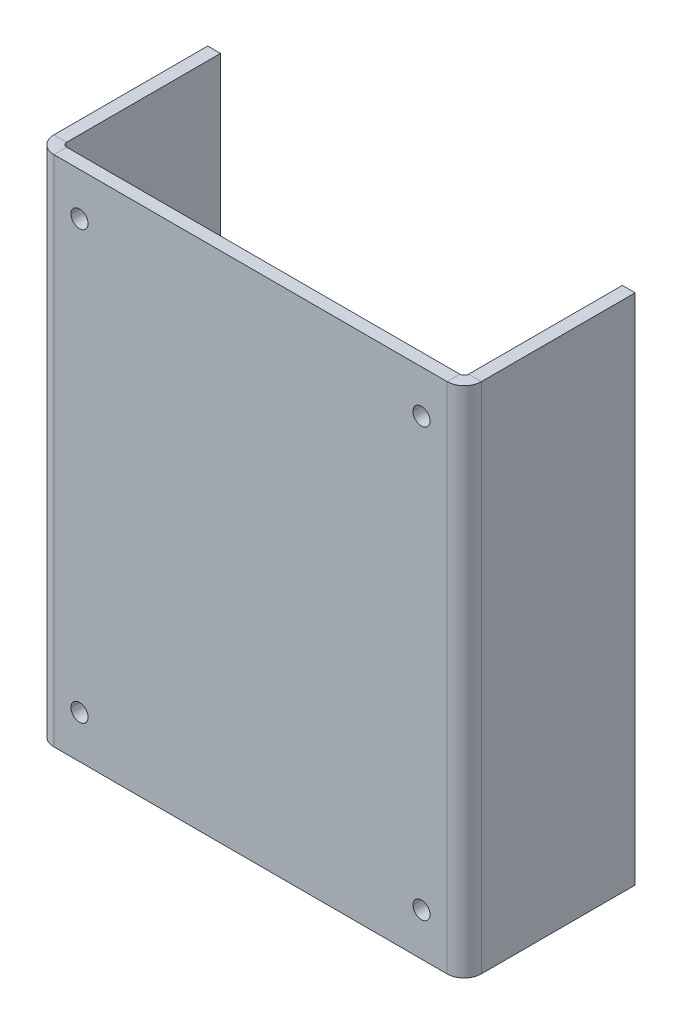
ISO-10303-21;
HEADER;
FILE_DESCRIPTION(('STEP AP214'),'2;1');
FILE_NAME('part.step','',(''),(''),'','','');
FILE_SCHEMA(('AUTOMOTIVE_DESIGN { 1 0 10303 214 1 1 1 1 }'));
ENDSEC;
DATA;
#1=APPLICATION_CONTEXT('core data for automotive mechanical design processes');
#2=APPLICATION_PROTOCOL_DEFINITION('international standard','automotive_design',2000,#1);
#3=PRODUCT_CONTEXT('',#1,'mechanical');
#4=PRODUCT('Part','Part','',(#3));
#5=PRODUCT_RELATED_PRODUCT_CATEGORY('part','',(#4));
#6=PRODUCT_DEFINITION_FORMATION('','',#4);
#7=PRODUCT_DEFINITION_CONTEXT('part definition',#1,'design');
#8=PRODUCT_DEFINITION('design','',#6,#7);
#9=PRODUCT_DEFINITION_SHAPE('','',#8);
#10=(LENGTH_UNIT() NAMED_UNIT(*) SI_UNIT(.MILLI.,.METRE.));
#11=(NAMED_UNIT(*) PLANE_ANGLE_UNIT() SI_UNIT($,.RADIAN.));
#12=(NAMED_UNIT(*) SI_UNIT($,.STERADIAN.) SOLID_ANGLE_UNIT());
#13=UNCERTAINTY_MEASURE_WITH_UNIT(LENGTH_MEASURE(1.E-05),#10,'distance_accuracy_value','');
#14=(GEOMETRIC_REPRESENTATION_CONTEXT(3) GLOBAL_UNCERTAINTY_ASSIGNED_CONTEXT((#13)) GLOBAL_UNIT_ASSIGNED_CONTEXT((#10,
#11,#12)) REPRESENTATION_CONTEXT('',''));
#15=CARTESIAN_POINT('',(0.,0.,0.));
#16=DIRECTION('',(0.,0.,1.));
#17=DIRECTION('',(1.,0.,0.));
#18=AXIS2_PLACEMENT_3D('',#15,#16,#17);
#19=CARTESIAN_POINT('',(-40.,10.,-40.001));
#20=DIRECTION('',(0.,0.,1.));
#21=DIRECTION('',(1.,0.,0.));
#22=AXIS2_PLACEMENT_3D('',#19,#20,#21);
#23=CYLINDRICAL_SURFACE('',#22,2.);
#24=DIRECTION('',(0.,0.,1.));
#25=VECTOR('',#24,1.);
#26=CARTESIAN_POINT('',(-42.,10.,-40.001));
#27=LINE('',#26,#25);
#28=CARTESIAN_POINT('',(-42.,10.,-3.));
#29=VERTEX_POINT('',#28);
#30=CARTESIAN_POINT('',(-42.,10.,-7.77156117277904E-13));
#31=VERTEX_POINT('',#30);
#32=EDGE_CURVE('E323',#29,#31,#27,.T.);
#33=ORIENTED_EDGE('',*,*,#32,.F.);
#34=CARTESIAN_POINT('',(-40.,10.,-3.));
#35=DIRECTION('',(0.,0.,-1.));
#36=DIRECTION('',(1.,0.,0.));
#37=AXIS2_PLACEMENT_3D('',#34,#35,#36);
#38=CIRCLE('',#37,2.);
#39=CARTESIAN_POINT('',(-38.,10.,-3.));
#40=VERTEX_POINT('',#39);
#41=EDGE_CURVE('E314',#29,#40,#38,.T.);
#42=ORIENTED_EDGE('',*,*,#41,.T.);
#43=DIRECTION('',(0.,0.,1.));
#44=VECTOR('',#43,1.);
#45=CARTESIAN_POINT('',(-38.,10.,-40.001));
#46=LINE('',#45,#44);
#47=CARTESIAN_POINT('',(-38.,10.,-7.77156117291914E-13));
#48=VERTEX_POINT('',#47);
#49=EDGE_CURVE('E271',#40,#48,#46,.T.);
#50=ORIENTED_EDGE('',*,*,#49,.T.);
#51=CARTESIAN_POINT('',(-40.,10.,-7.7715611723761E-13));
#52=DIRECTION('',(0.,0.,1.));
#53=DIRECTION('',(1.,0.,0.));
#54=AXIS2_PLACEMENT_3D('',#51,#52,#53);
#55=CIRCLE('',#54,2.);
#56=EDGE_CURVE('E281',#48,#31,#55,.T.);
#57=ORIENTED_EDGE('',*,*,#56,.T.);
#58=EDGE_LOOP('',(#33,#42,#50,#57));
#59=FACE_BOUND('',#58,.T.);
#60=ADVANCED_FACE('F17',(#59),#23,.F.);
#61=CARTESIAN_POINT('',(40.,10.,-40.001));
#62=DIRECTION('',(0.,0.,1.));
#63=DIRECTION('',(1.,0.,0.));
#64=AXIS2_PLACEMENT_3D('',#61,#62,#63);
#65=CYLINDRICAL_SURFACE('',#64,2.);
#66=DIRECTION('',(0.,0.,1.));
#67=VECTOR('',#66,1.);
#68=CARTESIAN_POINT('',(38.,10.,-40.001));
#69=LINE('',#68,#67);
#70=CARTESIAN_POINT('',(38.,10.,-3.));
#71=VERTEX_POINT('',#70);
#72=CARTESIAN_POINT('',(38.,10.,0.));
#73=VERTEX_POINT('',#72);
#74=EDGE_CURVE('E270',#71,#73,#69,.T.);
#75=ORIENTED_EDGE('',*,*,#74,.F.);
#76=CARTESIAN_POINT('',(40.,10.,-3.));
#77=DIRECTION('',(0.,0.,-1.));
#78=DIRECTION('',(1.,0.,0.));
#79=AXIS2_PLACEMENT_3D('',#76,#77,#78);
#80=CIRCLE('',#79,2.);
#81=CARTESIAN_POINT('',(42.,10.,-3.));
#82=VERTEX_POINT('',#81);
#83=EDGE_CURVE('E350',#71,#82,#80,.T.);
#84=ORIENTED_EDGE('',*,*,#83,.T.);
#85=DIRECTION('',(0.,0.,1.));
#86=VECTOR('',#85,1.);
#87=CARTESIAN_POINT('',(42.,10.,-40.001));
#88=LINE('',#87,#86);
#89=CARTESIAN_POINT('',(42.,10.0000000000009,0.));
#90=VERTEX_POINT('',#89);
#91=EDGE_CURVE('E295',#82,#90,#88,.T.);
#92=ORIENTED_EDGE('',*,*,#91,.T.);
#93=CARTESIAN_POINT('',(40.,10.0000000000009,0.));
#94=DIRECTION('',(0.,0.,1.));
#95=DIRECTION('',(1.,0.,0.));
#96=AXIS2_PLACEMENT_3D('',#93,#94,#95);
#97=CIRCLE('',#96,2.);
#98=EDGE_CURVE('E335',#90,#73,#97,.T.);
#99=ORIENTED_EDGE('',*,*,#98,.T.);
#100=EDGE_LOOP('',(#75,#84,#92,#99));
#101=FACE_BOUND('',#100,.T.);
#102=ADVANCED_FACE('F754',(#101),#65,.F.);
#103=CARTESIAN_POINT('',(40.,110.,-40.001));
#104=DIRECTION('',(0.,0.,1.));
#105=DIRECTION('',(1.,0.,0.));
#106=AXIS2_PLACEMENT_3D('',#103,#104,#105);
#107=CYLINDRICAL_SURFACE('',#106,2.);
#108=DIRECTION('',(0.,0.,1.));
#109=VECTOR('',#108,1.);
#110=CARTESIAN_POINT('',(38.,110.,-40.001));
#111=LINE('',#110,#109);
#112=CARTESIAN_POINT('',(38.,110.,-3.00000000000078));
#113=VERTEX_POINT('',#112);
#114=CARTESIAN_POINT('',(38.,110.,-7.77156117277904E-13));
#115=VERTEX_POINT('',#114);
#116=EDGE_CURVE('E438',#113,#115,#111,.T.);
#117=ORIENTED_EDGE('',*,*,#116,.F.);
#118=CARTESIAN_POINT('',(40.,110.,-3.00000000000078));
#119=DIRECTION('',(0.,0.,-1.));
#120=DIRECTION('',(1.,0.,0.));
#121=AXIS2_PLACEMENT_3D('',#118,#119,#120);
#122=CIRCLE('',#121,2.);
#123=CARTESIAN_POINT('',(42.,110.,-3.00000000000078));
#124=VERTEX_POINT('',#123);
#125=EDGE_CURVE('E28',#113,#124,#122,.T.);
#126=ORIENTED_EDGE('',*,*,#125,.T.);
#127=DIRECTION('',(0.,0.,1.));
#128=VECTOR('',#127,1.);
#129=CARTESIAN_POINT('',(42.,110.,-40.001));
#130=LINE('',#129,#128);
#131=CARTESIAN_POINT('',(42.,110.,-7.77156117291914E-13));
#132=VERTEX_POINT('',#131);
#133=EDGE_CURVE('E290',#124,#132,#130,.T.);
#134=ORIENTED_EDGE('',*,*,#133,.T.);
#135=CARTESIAN_POINT('',(40.,110.,-7.7715611723761E-13));
#136=DIRECTION('',(0.,0.,1.));
#137=DIRECTION('',(1.,0.,0.));
#138=AXIS2_PLACEMENT_3D('',#135,#136,#137);
#139=CIRCLE('',#138,2.);
#140=EDGE_CURVE('E127',#132,#115,#139,.T.);
#141=ORIENTED_EDGE('',*,*,#140,.T.);
#142=EDGE_LOOP('',(#117,#126,#134,#141));
#143=FACE_BOUND('',#142,.T.);
#144=ADVANCED_FACE('F750',(#143),#107,.F.);
#145=CARTESIAN_POINT('',(-40.,110.,-40.001));
#146=DIRECTION('',(0.,0.,1.));
#147=DIRECTION('',(1.,0.,0.));
#148=AXIS2_PLACEMENT_3D('',#145,#146,#147);
#149=CYLINDRICAL_SURFACE('',#148,2.);
#150=DIRECTION('',(0.,0.,1.));
#151=VECTOR('',#150,1.);
#152=CARTESIAN_POINT('',(-42.,110.,-40.001));
#153=LINE('',#152,#151);
#154=CARTESIAN_POINT('',(-42.,110.,-3.00000000000078));
#155=VERTEX_POINT('',#154);
#156=CARTESIAN_POINT('',(-42.,110.,0.));
#157=VERTEX_POINT('',#156);
#158=EDGE_CURVE('E289',#155,#157,#153,.T.);
#159=ORIENTED_EDGE('',*,*,#158,.F.);
#160=CARTESIAN_POINT('',(-40.,110.,-3.00000000000078));
#161=DIRECTION('',(0.,0.,-1.));
#162=DIRECTION('',(1.,0.,0.));
#163=AXIS2_PLACEMENT_3D('',#160,#161,#162);
#164=CIRCLE('',#163,2.);
#165=CARTESIAN_POINT('',(-38.,110.,-3.00000000000078));
#166=VERTEX_POINT('',#165);
#167=EDGE_CURVE('E11',#155,#166,#164,.T.);
#168=ORIENTED_EDGE('',*,*,#167,.T.);
#169=DIRECTION('',(0.,0.,1.));
#170=VECTOR('',#169,1.);
#171=CARTESIAN_POINT('',(-38.,110.,-40.001));
#172=LINE('',#171,#170);
#173=CARTESIAN_POINT('',(-38.,110.,0.));
#174=VERTEX_POINT('',#173);
#175=EDGE_CURVE('E288',#166,#174,#172,.T.);
#176=ORIENTED_EDGE('',*,*,#175,.T.);
#177=CARTESIAN_POINT('',(-40.,110.,0.));
#178=DIRECTION('',(0.,0.,1.));
#179=DIRECTION('',(1.,0.,0.));
#180=AXIS2_PLACEMENT_3D('',#177,#178,#179);
#181=CIRCLE('',#180,2.);
#182=EDGE_CURVE('E308',#174,#157,#181,.T.);
#183=ORIENTED_EDGE('',*,*,#182,.T.);
#184=EDGE_LOOP('',(#159,#168,#176,#183));
#185=FACE_BOUND('',#184,.T.);
#186=ADVANCED_FACE('F714',(#185),#149,.F.);
#187=CARTESIAN_POINT('',(-46.,6.66133814775094E-13,-4.));
#188=DIRECTION('',(0.,1.,0.));
#189=DIRECTION('',(1.,0.,0.));
#190=AXIS2_PLACEMENT_3D('',#187,#188,#189);
#191=PLANE('',#190);
#192=DIRECTION('',(0.,0.,-1.));
#193=VECTOR('',#192,1.);
#194=CARTESIAN_POINT('',(-47.,0.,0.));
#195=LINE('',#194,#193);
#196=CARTESIAN_POINT('',(-47.,0.,-4.));
#197=VERTEX_POINT('',#196);
#198=CARTESIAN_POINT('',(-47.,0.,-40.));
#199=VERTEX_POINT('',#198);
#200=EDGE_CURVE('E217',#197,#199,#195,.T.);
#201=ORIENTED_EDGE('',*,*,#200,.F.);
#202=DIRECTION('',(-1.,0.,0.));
#203=VECTOR('',#202,1.);
#204=CARTESIAN_POINT('',(-47.,0.,-4.));
#205=LINE('',#204,#203);
#206=CARTESIAN_POINT('',(-50.,-6.66133814775094E-13,-4.));
#207=VERTEX_POINT('',#206);
#208=EDGE_CURVE('E392',#197,#207,#205,.T.);
#209=ORIENTED_EDGE('',*,*,#208,.T.);
#210=DIRECTION('',(0.,0.,-1.));
#211=VECTOR('',#210,1.);
#212=CARTESIAN_POINT('',(-50.,0.,-7.7715611723761E-13));
#213=LINE('',#212,#211);
#214=CARTESIAN_POINT('',(-50.,0.,-40.));
#215=VERTEX_POINT('',#214);
#216=EDGE_CURVE('E304',#207,#215,#213,.T.);
#217=ORIENTED_EDGE('',*,*,#216,.T.);
#218=DIRECTION('',(1.,0.,0.));
#219=VECTOR('',#218,1.);
#220=CARTESIAN_POINT('',(-50.,0.,-40.));
#221=LINE('',#220,#219);
#222=EDGE_CURVE('E328',#215,#199,#221,.T.);
#223=ORIENTED_EDGE('',*,*,#222,.T.);
#224=EDGE_LOOP('',(#201,#209,#217,#223));
#225=FACE_BOUND('',#224,.T.);
#226=ADVANCED_FACE('F709',(#225),#191,.F.);
#227=CARTESIAN_POINT('',(-46.,120.,-4.));
#228=DIRECTION('',(0.,1.,0.));
#229=DIRECTION('',(1.,0.,0.));
#230=AXIS2_PLACEMENT_3D('',#227,#228,#229);
#231=PLANE('',#230);
#232=DIRECTION('',(0.,0.,1.));
#233=VECTOR('',#232,1.);
#234=CARTESIAN_POINT('',(47.,120.,0.));
#235=LINE('',#234,#233);
#236=CARTESIAN_POINT('',(47.,120.,-40.));
#237=VERTEX_POINT('',#236);
#238=CARTESIAN_POINT('',(47.,120.,-4.));
#239=VERTEX_POINT('',#238);
#240=EDGE_CURVE('E43',#237,#239,#235,.T.);
#241=ORIENTED_EDGE('',*,*,#240,.T.);
#242=DIRECTION('',(1.,0.,0.));
#243=VECTOR('',#242,1.);
#244=CARTESIAN_POINT('',(47.,120.,-4.));
#245=LINE('',#244,#243);
#246=CARTESIAN_POINT('',(50.,120.,-4.));
#247=VERTEX_POINT('',#246);
#248=EDGE_CURVE('E343',#239,#247,#245,.T.);
#249=ORIENTED_EDGE('',*,*,#248,.T.);
#250=DIRECTION('',(0.,0.,1.));
#251=VECTOR('',#250,1.);
#252=CARTESIAN_POINT('',(50.,120.,0.));
#253=LINE('',#252,#251);
#254=CARTESIAN_POINT('',(50.,120.,-40.));
#255=VERTEX_POINT('',#254);
#256=EDGE_CURVE('E329',#255,#247,#253,.T.);
#257=ORIENTED_EDGE('',*,*,#256,.F.);
#258=DIRECTION('',(1.,0.,0.));
#259=VECTOR('',#258,1.);
#260=CARTESIAN_POINT('',(47.,120.,-40.));
#261=LINE('',#260,#259);
#262=EDGE_CURVE('E315',#237,#255,#261,.T.);
#263=ORIENTED_EDGE('',*,*,#262,.F.);
#264=EDGE_LOOP('',(#241,#249,#257,#263));
#265=FACE_BOUND('',#264,.T.);
#266=ADVANCED_FACE('F713',(#265),#231,.T.);
#267=CARTESIAN_POINT('',(-46.,120.,-4.));
#268=DIRECTION('',(0.,-1.,0.));
#269=DIRECTION('',(0.,0.,-1.));
#270=AXIS2_PLACEMENT_3D('',#267,#268,#269);
#271=CYLINDRICAL_SURFACE('',#270,1.);
#272=CARTESIAN_POINT('',(-46.,6.66133814775094E-13,-4.));
#273=DIRECTION('',(0.,-1.,0.));
#274=DIRECTION('',(1.,0.,0.));
#275=AXIS2_PLACEMENT_3D('',#272,#273,#274);
#276=CIRCLE('',#275,1.);
#277=CARTESIAN_POINT('',(-46.,0.,-3.));
#278=VERTEX_POINT('',#277);
#279=EDGE_CURVE('E255',#278,#197,#276,.T.);
#280=ORIENTED_EDGE('',*,*,#279,.T.);
#281=DIRECTION('',(0.,-1.,0.));
#282=VECTOR('',#281,1.);
#283=CARTESIAN_POINT('',(-47.,120.,-4.));
#284=LINE('',#283,#282);
#285=CARTESIAN_POINT('',(-47.,120.,-4.));
#286=VERTEX_POINT('',#285);
#287=EDGE_CURVE('E221',#286,#197,#284,.T.);
#288=ORIENTED_EDGE('',*,*,#287,.F.);
#289=CARTESIAN_POINT('',(-46.,120.,-4.));
#290=DIRECTION('',(0.,-1.,0.));
#291=DIRECTION('',(1.,0.,0.));
#292=AXIS2_PLACEMENT_3D('',#289,#290,#291);
#293=CIRCLE('',#292,1.);
#294=CARTESIAN_POINT('',(-46.,120.,-3.00000000000078));
#295=VERTEX_POINT('',#294);
#296=EDGE_CURVE('E243',#295,#286,#293,.T.);
#297=ORIENTED_EDGE('',*,*,#296,.F.);
#298=DIRECTION('',(0.,-1.,0.));
#299=VECTOR('',#298,1.);
#300=CARTESIAN_POINT('',(-46.,120.,-3.00000000000078));
#301=LINE('',#300,#299);
#302=EDGE_CURVE('E302',#295,#278,#301,.T.);
#303=ORIENTED_EDGE('',*,*,#302,.T.);
#304=EDGE_LOOP('',(#280,#288,#297,#303));
#305=FACE_BOUND('',#304,.T.);
#306=ADVANCED_FACE('F685',(#305),#271,.F.);
#307=CARTESIAN_POINT('',(-50.,120.,-3.));
#308=DIRECTION('',(0.,0.,1.));
#309=DIRECTION('',(1.,0.,0.));
#310=AXIS2_PLACEMENT_3D('',#307,#308,#309);
#311=PLANE('',#310);
#312=CARTESIAN_POINT('',(-40.,110.,-3.00000000000078));
#313=DIRECTION('',(0.,0.,-1.));
#314=DIRECTION('',(1.,0.,0.));
#315=AXIS2_PLACEMENT_3D('',#312,#313,#314);
#316=CIRCLE('',#315,2.);
#317=EDGE_CURVE('E293',#166,#155,#316,.T.);
#318=ORIENTED_EDGE('',*,*,#317,.F.);
#319=ORIENTED_EDGE('',*,*,#167,.F.);
#320=EDGE_LOOP('',(#318,#319));
#321=FACE_BOUND('',#320,.T.);
#322=CARTESIAN_POINT('',(40.,110.,-3.00000000000078));
#323=DIRECTION('',(0.,0.,-1.));
#324=DIRECTION('',(1.,0.,0.));
#325=AXIS2_PLACEMENT_3D('',#322,#323,#324);
#326=CIRCLE('',#325,2.);
#327=EDGE_CURVE('E299',#124,#113,#326,.T.);
#328=ORIENTED_EDGE('',*,*,#327,.F.);
#329=ORIENTED_EDGE('',*,*,#125,.F.);
#330=EDGE_LOOP('',(#328,#329));
#331=FACE_BOUND('',#330,.T.);
#332=CARTESIAN_POINT('',(40.,10.,-3.));
#333=DIRECTION('',(0.,0.,-1.));
#334=DIRECTION('',(1.,0.,0.));
#335=AXIS2_PLACEMENT_3D('',#332,#333,#334);
#336=CIRCLE('',#335,2.);
#337=EDGE_CURVE('E266',#82,#71,#336,.T.);
#338=ORIENTED_EDGE('',*,*,#337,.F.);
#339=ORIENTED_EDGE('',*,*,#83,.F.);
#340=EDGE_LOOP('',(#338,#339));
#341=FACE_BOUND('',#340,.T.);
#342=CARTESIAN_POINT('',(-40.,10.,-3.));
#343=DIRECTION('',(0.,0.,-1.));
#344=DIRECTION('',(1.,0.,0.));
#345=AXIS2_PLACEMENT_3D('',#342,#343,#344);
#346=CIRCLE('',#345,2.);
#347=EDGE_CURVE('E416',#40,#29,#346,.T.);
#348=ORIENTED_EDGE('',*,*,#347,.F.);
#349=ORIENTED_EDGE('',*,*,#41,.F.);
#350=EDGE_LOOP('',(#348,#349));
#351=FACE_BOUND('',#350,.T.);
#352=DIRECTION('',(-1.,0.,0.));
#353=VECTOR('',#352,1.);
#354=CARTESIAN_POINT('',(-50.,6.66133814775094E-13,-3.));
#355=LINE('',#354,#353);
#356=CARTESIAN_POINT('',(46.,0.,-3.));
#357=VERTEX_POINT('',#356);
#358=EDGE_CURVE('E272',#357,#278,#355,.T.);
#359=ORIENTED_EDGE('',*,*,#358,.T.);
#360=ORIENTED_EDGE('',*,*,#302,.F.);
#361=DIRECTION('',(-1.,0.,0.));
#362=VECTOR('',#361,1.);
#363=CARTESIAN_POINT('',(-50.,120.,-3.));
#364=LINE('',#363,#362);
#365=CARTESIAN_POINT('',(46.,120.,-3.));
#366=VERTEX_POINT('',#365);
#367=EDGE_CURVE('E257',#366,#295,#364,.T.);
#368=ORIENTED_EDGE('',*,*,#367,.F.);
#369=DIRECTION('',(0.,-1.,0.));
#370=VECTOR('',#369,1.);
#371=CARTESIAN_POINT('',(46.,120.,-3.));
#372=LINE('',#371,#370);
#373=EDGE_CURVE('E264',#366,#357,#372,.T.);
#374=ORIENTED_EDGE('',*,*,#373,.T.);
#375=EDGE_LOOP('',(#359,#360,#368,#374));
#376=FACE_BOUND('',#375,.T.);
#377=ADVANCED_FACE('F459',(#321,#331,#341,#351,#376),#311,.F.);
#378=CARTESIAN_POINT('',(46.,120.,-4.));
#379=DIRECTION('',(0.,-1.,0.));
#380=DIRECTION('',(0.,0.,-1.));
#381=AXIS2_PLACEMENT_3D('',#378,#379,#380);
#382=CYLINDRICAL_SURFACE('',#381,1.);
#383=CARTESIAN_POINT('',(46.,0.,-4.));
#384=DIRECTION('',(0.,-1.,0.));
#385=DIRECTION('',(1.,0.,0.));
#386=AXIS2_PLACEMENT_3D('',#383,#384,#385);
#387=CIRCLE('',#386,1.);
#388=CARTESIAN_POINT('',(47.,0.,-4.));
#389=VERTEX_POINT('',#388);
#390=EDGE_CURVE('E479',#389,#357,#387,.T.);
#391=ORIENTED_EDGE('',*,*,#390,.T.);
#392=ORIENTED_EDGE('',*,*,#373,.F.);
#393=CARTESIAN_POINT('',(46.,120.,-4.));
#394=DIRECTION('',(0.,-1.,0.));
#395=DIRECTION('',(1.,0.,0.));
#396=AXIS2_PLACEMENT_3D('',#393,#394,#395);
#397=CIRCLE('',#396,1.);
#398=EDGE_CURVE('E362',#239,#366,#397,.T.);
#399=ORIENTED_EDGE('',*,*,#398,.F.);
#400=DIRECTION('',(0.,-1.,0.));
#401=VECTOR('',#400,1.);
#402=CARTESIAN_POINT('',(47.,120.,-4.));
#403=LINE('',#402,#401);
#404=EDGE_CURVE('E265',#239,#389,#403,.T.);
#405=ORIENTED_EDGE('',*,*,#404,.T.);
#406=EDGE_LOOP('',(#391,#392,#399,#405));
#407=FACE_BOUND('',#406,.T.);
#408=ADVANCED_FACE('F684',(#407),#382,.F.);
#409=CARTESIAN_POINT('',(47.,120.,0.));
#410=DIRECTION('',(1.,0.,0.));
#411=DIRECTION('',(0.,-1.,0.));
#412=AXIS2_PLACEMENT_3D('',#409,#410,#411);
#413=PLANE('',#412);
#414=DIRECTION('',(0.,0.,1.));
#415=VECTOR('',#414,1.);
#416=CARTESIAN_POINT('',(47.,0.,-7.7715611723761E-13));
#417=LINE('',#416,#415);
#418=CARTESIAN_POINT('',(47.,0.,-40.));
#419=VERTEX_POINT('',#418);
#420=EDGE_CURVE('E419',#419,#389,#417,.T.);
#421=ORIENTED_EDGE('',*,*,#420,.T.);
#422=ORIENTED_EDGE('',*,*,#404,.F.);
#423=ORIENTED_EDGE('',*,*,#240,.F.);
#424=DIRECTION('',(0.,-1.,0.));
#425=VECTOR('',#424,1.);
#426=CARTESIAN_POINT('',(47.,120.,-40.));
#427=LINE('',#426,#425);
#428=EDGE_CURVE('E317',#237,#419,#427,.T.);
#429=ORIENTED_EDGE('',*,*,#428,.T.);
#430=EDGE_LOOP('',(#421,#422,#423,#429));
#431=FACE_BOUND('',#430,.T.);
#432=ADVANCED_FACE('F695',(#431),#413,.F.);
#433=CARTESIAN_POINT('',(47.,120.,-40.));
#434=DIRECTION('',(0.,0.,-1.));
#435=DIRECTION('',(-1.,0.,0.));
#436=AXIS2_PLACEMENT_3D('',#433,#434,#435);
#437=PLANE('',#436);
#438=DIRECTION('',(1.,0.,0.));
#439=VECTOR('',#438,1.);
#440=CARTESIAN_POINT('',(47.,0.,-40.));
#441=LINE('',#440,#439);
#442=CARTESIAN_POINT('',(50.,0.,-40.));
#443=VERTEX_POINT('',#442);
#444=EDGE_CURVE('E383',#419,#443,#441,.T.);
#445=ORIENTED_EDGE('',*,*,#444,.F.);
#446=ORIENTED_EDGE('',*,*,#428,.F.);
#447=ORIENTED_EDGE('',*,*,#262,.T.);
#448=DIRECTION('',(0.,-1.,0.));
#449=VECTOR('',#448,1.);
#450=CARTESIAN_POINT('',(50.,120.,-40.));
#451=LINE('',#450,#449);
#452=EDGE_CURVE('E332',#255,#443,#451,.T.);
#453=ORIENTED_EDGE('',*,*,#452,.T.);
#454=EDGE_LOOP('',(#445,#446,#447,#453));
#455=FACE_BOUND('',#454,.T.);
#456=ADVANCED_FACE('F691',(#455),#437,.T.);
#457=CARTESIAN_POINT('',(50.,120.,0.));
#458=DIRECTION('',(1.,0.,0.));
#459=DIRECTION('',(0.,-1.,0.));
#460=AXIS2_PLACEMENT_3D('',#457,#458,#459);
#461=PLANE('',#460);
#462=DIRECTION('',(0.,0.,1.));
#463=VECTOR('',#462,1.);
#464=CARTESIAN_POINT('',(50.,0.,0.));
#465=LINE('',#464,#463);
#466=CARTESIAN_POINT('',(50.,0.,-4.));
#467=VERTEX_POINT('',#466);
#468=EDGE_CURVE('E423',#443,#467,#465,.T.);
#469=ORIENTED_EDGE('',*,*,#468,.F.);
#470=ORIENTED_EDGE('',*,*,#452,.F.);
#471=ORIENTED_EDGE('',*,*,#256,.T.);
#472=DIRECTION('',(0.,-1.,0.));
#473=VECTOR('',#472,1.);
#474=CARTESIAN_POINT('',(50.,120.,-4.));
#475=LINE('',#474,#473);
#476=EDGE_CURVE('E311',#247,#467,#475,.T.);
#477=ORIENTED_EDGE('',*,*,#476,.T.);
#478=EDGE_LOOP('',(#469,#470,#471,#477));
#479=FACE_BOUND('',#478,.T.);
#480=ADVANCED_FACE('F659',(#479),#461,.T.);
#481=CARTESIAN_POINT('',(46.,120.,-4.));
#482=DIRECTION('',(0.,-1.,0.));
#483=DIRECTION('',(0.,0.,-1.));
#484=AXIS2_PLACEMENT_3D('',#481,#482,#483);
#485=CYLINDRICAL_SURFACE('',#484,4.);
#486=CARTESIAN_POINT('',(46.,0.,-4.));
#487=DIRECTION('',(0.,-1.,0.));
#488=DIRECTION('',(0.,0.,1.));
#489=AXIS2_PLACEMENT_3D('',#486,#487,#488);
#490=CIRCLE('',#489,4.);
#491=CARTESIAN_POINT('',(46.,0.,-7.7715611723761E-13));
#492=VERTEX_POINT('',#491);
#493=EDGE_CURVE('E371',#467,#492,#490,.T.);
#494=ORIENTED_EDGE('',*,*,#493,.F.);
#495=ORIENTED_EDGE('',*,*,#476,.F.);
#496=CARTESIAN_POINT('',(46.,120.,-4.));
#497=DIRECTION('',(0.,-1.,0.));
#498=DIRECTION('',(0.,0.,1.));
#499=AXIS2_PLACEMENT_3D('',#496,#497,#498);
#500=CIRCLE('',#499,4.);
#501=CARTESIAN_POINT('',(46.,120.,0.));
#502=VERTEX_POINT('',#501);
#503=EDGE_CURVE('E339',#247,#502,#500,.T.);
#504=ORIENTED_EDGE('',*,*,#503,.T.);
#505=DIRECTION('',(0.,-1.,0.));
#506=VECTOR('',#505,1.);
#507=CARTESIAN_POINT('',(46.,120.,0.));
#508=LINE('',#507,#506);
#509=EDGE_CURVE('E277',#502,#492,#508,.T.);
#510=ORIENTED_EDGE('',*,*,#509,.T.);
#511=EDGE_LOOP('',(#494,#495,#504,#510));
#512=FACE_BOUND('',#511,.T.);
#513=ADVANCED_FACE('F467',(#512),#485,.T.);
#514=CARTESIAN_POINT('',(-50.,120.,0.));
#515=DIRECTION('',(0.,0.,1.));
#516=DIRECTION('',(1.,0.,0.));
#517=AXIS2_PLACEMENT_3D('',#514,#515,#516);
#518=PLANE('',#517);
#519=ORIENTED_EDGE('',*,*,#182,.F.);
#520=CARTESIAN_POINT('',(-40.,110.,0.));
#521=DIRECTION('',(0.,0.,1.));
#522=DIRECTION('',(1.,0.,0.));
#523=AXIS2_PLACEMENT_3D('',#520,#521,#522);
#524=CIRCLE('',#523,2.);
#525=EDGE_CURVE('E284',#157,#174,#524,.T.);
#526=ORIENTED_EDGE('',*,*,#525,.F.);
#527=EDGE_LOOP('',(#519,#526));
#528=FACE_BOUND('',#527,.T.);
#529=ORIENTED_EDGE('',*,*,#140,.F.);
#530=CARTESIAN_POINT('',(40.,110.,-7.7715611723761E-13));
#531=DIRECTION('',(0.,0.,1.));
#532=DIRECTION('',(1.,0.,0.));
#533=AXIS2_PLACEMENT_3D('',#530,#531,#532);
#534=CIRCLE('',#533,2.);
#535=EDGE_CURVE('E294',#115,#132,#534,.T.);
#536=ORIENTED_EDGE('',*,*,#535,.F.);
#537=EDGE_LOOP('',(#529,#536));
#538=FACE_BOUND('',#537,.T.);
#539=ORIENTED_EDGE('',*,*,#98,.F.);
#540=CARTESIAN_POINT('',(40.,10.0000000000009,0.));
#541=DIRECTION('',(0.,0.,1.));
#542=DIRECTION('',(1.,0.,0.));
#543=AXIS2_PLACEMENT_3D('',#540,#541,#542);
#544=CIRCLE('',#543,2.);
#545=EDGE_CURVE('E300',#73,#90,#544,.T.);
#546=ORIENTED_EDGE('',*,*,#545,.F.);
#547=EDGE_LOOP('',(#539,#546));
#548=FACE_BOUND('',#547,.T.);
#549=ORIENTED_EDGE('',*,*,#56,.F.);
#550=CARTESIAN_POINT('',(-40.,10.,-7.7715611723761E-13));
#551=DIRECTION('',(0.,0.,1.));
#552=DIRECTION('',(1.,0.,0.));
#553=AXIS2_PLACEMENT_3D('',#550,#551,#552);
#554=CIRCLE('',#553,2.);
#555=EDGE_CURVE('E319',#31,#48,#554,.T.);
#556=ORIENTED_EDGE('',*,*,#555,.F.);
#557=EDGE_LOOP('',(#549,#556));
#558=FACE_BOUND('',#557,.T.);
#559=DIRECTION('',(-1.,0.,0.));
#560=VECTOR('',#559,1.);
#561=CARTESIAN_POINT('',(-50.,0.,-7.7715611723761E-13));
#562=LINE('',#561,#560);
#563=CARTESIAN_POINT('',(-46.,0.,0.));
#564=VERTEX_POINT('',#563);
#565=EDGE_CURVE('E276',#492,#564,#562,.T.);
#566=ORIENTED_EDGE('',*,*,#565,.F.);
#567=ORIENTED_EDGE('',*,*,#509,.F.);
#568=DIRECTION('',(-1.,0.,0.));
#569=VECTOR('',#568,1.);
#570=CARTESIAN_POINT('',(-50.,120.,0.));
#571=LINE('',#570,#569);
#572=CARTESIAN_POINT('',(-46.,120.,0.));
#573=VERTEX_POINT('',#572);
#574=EDGE_CURVE('E261',#502,#573,#571,.T.);
#575=ORIENTED_EDGE('',*,*,#574,.T.);
#576=DIRECTION('',(0.,-1.,0.));
#577=VECTOR('',#576,1.);
#578=CARTESIAN_POINT('',(-46.,120.,0.));
#579=LINE('',#578,#577);
#580=EDGE_CURVE('E202',#573,#564,#579,.T.);
#581=ORIENTED_EDGE('',*,*,#580,.T.);
#582=EDGE_LOOP('',(#566,#567,#575,#581));
#583=FACE_BOUND('',#582,.T.);
#584=ADVANCED_FACE('F464',(#528,#538,#548,#558,#583),#518,.T.);
#585=CARTESIAN_POINT('',(-46.,120.,-4.));
#586=DIRECTION('',(0.,-1.,0.));
#587=DIRECTION('',(0.,0.,-1.));
#588=AXIS2_PLACEMENT_3D('',#585,#586,#587);
#589=CYLINDRICAL_SURFACE('',#588,4.);
#590=CARTESIAN_POINT('',(-46.,6.66133814775094E-13,-4.));
#591=DIRECTION('',(0.,-1.,0.));
#592=DIRECTION('',(0.,0.,1.));
#593=AXIS2_PLACEMENT_3D('',#590,#591,#592);
#594=CIRCLE('',#593,4.);
#595=EDGE_CURVE('E389',#564,#207,#594,.T.);
#596=ORIENTED_EDGE('',*,*,#595,.F.);
#597=ORIENTED_EDGE('',*,*,#580,.F.);
#598=CARTESIAN_POINT('',(-46.,120.,-4.));
#599=DIRECTION('',(0.,-1.,0.));
#600=DIRECTION('',(0.,0.,1.));
#601=AXIS2_PLACEMENT_3D('',#598,#599,#600);
#602=CIRCLE('',#601,4.);
#603=CARTESIAN_POINT('',(-50.,120.,-4.));
#604=VERTEX_POINT('',#603);
#605=EDGE_CURVE('E251',#573,#604,#602,.T.);
#606=ORIENTED_EDGE('',*,*,#605,.T.);
#607=DIRECTION('',(0.,-1.,0.));
#608=VECTOR('',#607,1.);
#609=CARTESIAN_POINT('',(-50.,120.,-4.));
#610=LINE('',#609,#608);
#611=EDGE_CURVE('E307',#604,#207,#610,.T.);
#612=ORIENTED_EDGE('',*,*,#611,.T.);
#613=EDGE_LOOP('',(#596,#597,#606,#612));
#614=FACE_BOUND('',#613,.T.);
#615=ADVANCED_FACE('F466',(#614),#589,.T.);
#616=CARTESIAN_POINT('',(-50.,120.,0.));
#617=DIRECTION('',(-1.,0.,0.));
#618=DIRECTION('',(0.,0.,1.));
#619=AXIS2_PLACEMENT_3D('',#616,#617,#618);
#620=PLANE('',#619);
#621=ORIENTED_EDGE('',*,*,#216,.F.);
#622=ORIENTED_EDGE('',*,*,#611,.F.);
#623=DIRECTION('',(0.,0.,-1.));
#624=VECTOR('',#623,1.);
#625=CARTESIAN_POINT('',(-50.,120.,0.));
#626=LINE('',#625,#624);
#627=CARTESIAN_POINT('',(-50.,120.,-40.));
#628=VERTEX_POINT('',#627);
#629=EDGE_CURVE('E238',#604,#628,#626,.T.);
#630=ORIENTED_EDGE('',*,*,#629,.T.);
#631=DIRECTION('',(0.,-1.,0.));
#632=VECTOR('',#631,1.);
#633=CARTESIAN_POINT('',(-50.,120.,-40.));
#634=LINE('',#633,#632);
#635=EDGE_CURVE('E227',#628,#215,#634,.T.);
#636=ORIENTED_EDGE('',*,*,#635,.T.);
#637=EDGE_LOOP('',(#621,#622,#630,#636));
#638=FACE_BOUND('',#637,.T.);
#639=ADVANCED_FACE('F648',(#638),#620,.T.);
#640=CARTESIAN_POINT('',(-50.,120.,-40.));
#641=DIRECTION('',(0.,0.,-1.));
#642=DIRECTION('',(-1.,0.,0.));
#643=AXIS2_PLACEMENT_3D('',#640,#641,#642);
#644=PLANE('',#643);
#645=ORIENTED_EDGE('',*,*,#222,.F.);
#646=ORIENTED_EDGE('',*,*,#635,.F.);
#647=DIRECTION('',(1.,0.,0.));
#648=VECTOR('',#647,1.);
#649=CARTESIAN_POINT('',(-50.,120.,-40.));
#650=LINE('',#649,#648);
#651=CARTESIAN_POINT('',(-47.,120.,-40.));
#652=VERTEX_POINT('',#651);
#653=EDGE_CURVE('E224',#628,#652,#650,.T.);
#654=ORIENTED_EDGE('',*,*,#653,.T.);
#655=DIRECTION('',(0.,-1.,0.));
#656=VECTOR('',#655,1.);
#657=CARTESIAN_POINT('',(-47.,120.,-40.));
#658=LINE('',#657,#656);
#659=EDGE_CURVE('E211',#652,#199,#658,.T.);
#660=ORIENTED_EDGE('',*,*,#659,.T.);
#661=EDGE_LOOP('',(#645,#646,#654,#660));
#662=FACE_BOUND('',#661,.T.);
#663=ADVANCED_FACE('F225',(#662),#644,.T.);
#664=CARTESIAN_POINT('',(-47.,120.,0.));
#665=DIRECTION('',(-1.,0.,0.));
#666=DIRECTION('',(0.,0.,1.));
#667=AXIS2_PLACEMENT_3D('',#664,#665,#666);
#668=PLANE('',#667);
#669=ORIENTED_EDGE('',*,*,#200,.T.);
#670=ORIENTED_EDGE('',*,*,#659,.F.);
#671=DIRECTION('',(0.,0.,-1.));
#672=VECTOR('',#671,1.);
#673=CARTESIAN_POINT('',(-47.,120.,0.));
#674=LINE('',#673,#672);
#675=EDGE_CURVE('E21',#286,#652,#674,.T.);
#676=ORIENTED_EDGE('',*,*,#675,.F.);
#677=ORIENTED_EDGE('',*,*,#287,.T.);
#678=EDGE_LOOP('',(#669,#670,#676,#677));
#679=FACE_BOUND('',#678,.T.);
#680=ADVANCED_FACE('F213',(#679),#668,.F.);
#681=CARTESIAN_POINT('',(-47.,0.,-4.));
#682=DIRECTION('',(0.,-1.,0.));
#683=DIRECTION('',(0.,0.,-1.));
#684=AXIS2_PLACEMENT_3D('',#681,#682,#683);
#685=PLANE('',#684);
#686=ORIENTED_EDGE('',*,*,#565,.T.);
#687=DIRECTION('',(0.,0.,-1.));
#688=VECTOR('',#687,1.);
#689=CARTESIAN_POINT('',(-46.,0.,0.));
#690=LINE('',#689,#688);
#691=EDGE_CURVE('E232',#564,#278,#690,.T.);
#692=ORIENTED_EDGE('',*,*,#691,.T.);
#693=ORIENTED_EDGE('',*,*,#358,.F.);
#694=DIRECTION('',(0.,0.,1.));
#695=VECTOR('',#694,1.);
#696=CARTESIAN_POINT('',(46.,0.,-3.));
#697=LINE('',#696,#695);
#698=EDGE_CURVE('E432',#357,#492,#697,.T.);
#699=ORIENTED_EDGE('',*,*,#698,.T.);
#700=EDGE_LOOP('',(#686,#692,#693,#699));
#701=FACE_BOUND('',#700,.T.);
#702=ADVANCED_FACE('F474',(#701),#685,.T.);
#703=CARTESIAN_POINT('',(-46.,0.,0.));
#704=DIRECTION('',(0.,-1.,0.));
#705=DIRECTION('',(0.,0.,-1.));
#706=AXIS2_PLACEMENT_3D('',#703,#704,#705);
#707=PLANE('',#706);
#708=ORIENTED_EDGE('',*,*,#691,.F.);
#709=ORIENTED_EDGE('',*,*,#595,.T.);
#710=ORIENTED_EDGE('',*,*,#208,.F.);
#711=ORIENTED_EDGE('',*,*,#279,.F.);
#712=EDGE_LOOP('',(#708,#709,#710,#711));
#713=FACE_BOUND('',#712,.T.);
#714=ADVANCED_FACE('F504',(#713),#707,.T.);
#715=CARTESIAN_POINT('',(-46.,120.,-3.00000000000078));
#716=DIRECTION('',(0.,1.,0.));
#717=DIRECTION('',(1.,0.,0.));
#718=AXIS2_PLACEMENT_3D('',#715,#716,#717);
#719=PLANE('',#718);
#720=ORIENTED_EDGE('',*,*,#629,.F.);
#721=DIRECTION('',(1.,0.,0.));
#722=VECTOR('',#721,1.);
#723=CARTESIAN_POINT('',(-50.,120.,-4.));
#724=LINE('',#723,#722);
#725=EDGE_CURVE('E236',#604,#286,#724,.T.);
#726=ORIENTED_EDGE('',*,*,#725,.T.);
#727=ORIENTED_EDGE('',*,*,#675,.T.);
#728=ORIENTED_EDGE('',*,*,#653,.F.);
#729=EDGE_LOOP('',(#720,#726,#727,#728));
#730=FACE_BOUND('',#729,.T.);
#731=ADVANCED_FACE('F234',(#730),#719,.T.);
#732=CARTESIAN_POINT('',(-50.,120.,-4.));
#733=DIRECTION('',(0.,1.,0.));
#734=DIRECTION('',(1.,0.,0.));
#735=AXIS2_PLACEMENT_3D('',#732,#733,#734);
#736=PLANE('',#735);
#737=ORIENTED_EDGE('',*,*,#725,.F.);
#738=ORIENTED_EDGE('',*,*,#605,.F.);
#739=DIRECTION('',(0.,0.,1.));
#740=VECTOR('',#739,1.);
#741=CARTESIAN_POINT('',(-46.,120.,-3.00000000000078));
#742=LINE('',#741,#740);
#743=EDGE_CURVE('E260',#295,#573,#742,.T.);
#744=ORIENTED_EDGE('',*,*,#743,.F.);
#745=ORIENTED_EDGE('',*,*,#296,.T.);
#746=EDGE_LOOP('',(#737,#738,#744,#745));
#747=FACE_BOUND('',#746,.T.);
#748=ADVANCED_FACE('F19',(#747),#736,.T.);
#749=CARTESIAN_POINT('',(46.,0.,-3.));
#750=DIRECTION('',(0.,-1.,0.));
#751=DIRECTION('',(0.,0.,-1.));
#752=AXIS2_PLACEMENT_3D('',#749,#750,#751);
#753=PLANE('',#752);
#754=ORIENTED_EDGE('',*,*,#468,.T.);
#755=DIRECTION('',(-1.,0.,0.));
#756=VECTOR('',#755,1.);
#757=CARTESIAN_POINT('',(50.,0.,-4.));
#758=LINE('',#757,#756);
#759=EDGE_CURVE('E367',#467,#389,#758,.T.);
#760=ORIENTED_EDGE('',*,*,#759,.T.);
#761=ORIENTED_EDGE('',*,*,#420,.F.);
#762=ORIENTED_EDGE('',*,*,#444,.T.);
#763=EDGE_LOOP('',(#754,#760,#761,#762));
#764=FACE_BOUND('',#763,.T.);
#765=ADVANCED_FACE('F789',(#764),#753,.T.);
#766=CARTESIAN_POINT('',(50.,0.,-4.));
#767=DIRECTION('',(0.,-1.,0.));
#768=DIRECTION('',(0.,0.,-1.));
#769=AXIS2_PLACEMENT_3D('',#766,#767,#768);
#770=PLANE('',#769);
#771=ORIENTED_EDGE('',*,*,#759,.F.);
#772=ORIENTED_EDGE('',*,*,#493,.T.);
#773=ORIENTED_EDGE('',*,*,#698,.F.);
#774=ORIENTED_EDGE('',*,*,#390,.F.);
#775=EDGE_LOOP('',(#771,#772,#773,#774));
#776=FACE_BOUND('',#775,.T.);
#777=ADVANCED_FACE('F483',(#776),#770,.T.);
#778=CARTESIAN_POINT('',(47.,120.,-4.));
#779=DIRECTION('',(0.,1.,0.));
#780=DIRECTION('',(1.,0.,0.));
#781=AXIS2_PLACEMENT_3D('',#778,#779,#780);
#782=PLANE('',#781);
#783=ORIENTED_EDGE('',*,*,#574,.F.);
#784=DIRECTION('',(0.,0.,-1.));
#785=VECTOR('',#784,1.);
#786=CARTESIAN_POINT('',(46.,120.,0.));
#787=LINE('',#786,#785);
#788=EDGE_CURVE('E344',#502,#366,#787,.T.);
#789=ORIENTED_EDGE('',*,*,#788,.T.);
#790=ORIENTED_EDGE('',*,*,#367,.T.);
#791=ORIENTED_EDGE('',*,*,#743,.T.);
#792=EDGE_LOOP('',(#783,#789,#790,#791));
#793=FACE_BOUND('',#792,.T.);
#794=ADVANCED_FACE('F495',(#793),#782,.T.);
#795=CARTESIAN_POINT('',(46.,120.,0.));
#796=DIRECTION('',(0.,1.,0.));
#797=DIRECTION('',(1.,0.,0.));
#798=AXIS2_PLACEMENT_3D('',#795,#796,#797);
#799=PLANE('',#798);
#800=ORIENTED_EDGE('',*,*,#788,.F.);
#801=ORIENTED_EDGE('',*,*,#503,.F.);
#802=ORIENTED_EDGE('',*,*,#248,.F.);
#803=ORIENTED_EDGE('',*,*,#398,.T.);
#804=EDGE_LOOP('',(#800,#801,#802,#803));
#805=FACE_BOUND('',#804,.T.);
#806=ADVANCED_FACE('F492',(#805),#799,.T.);
#807=CARTESIAN_POINT('',(-40.,110.,-40.001));
#808=DIRECTION('',(0.,0.,1.));
#809=DIRECTION('',(1.,0.,0.));
#810=AXIS2_PLACEMENT_3D('',#807,#808,#809);
#811=CYLINDRICAL_SURFACE('',#810,2.);
#812=ORIENTED_EDGE('',*,*,#317,.T.);
#813=ORIENTED_EDGE('',*,*,#158,.T.);
#814=ORIENTED_EDGE('',*,*,#525,.T.);
#815=ORIENTED_EDGE('',*,*,#175,.F.);
#816=EDGE_LOOP('',(#812,#813,#814,#815));
#817=FACE_BOUND('',#816,.T.);
#818=ADVANCED_FACE('F664',(#817),#811,.F.);
#819=CARTESIAN_POINT('',(40.,110.,-40.001));
#820=DIRECTION('',(0.,0.,1.));
#821=DIRECTION('',(1.,0.,0.));
#822=AXIS2_PLACEMENT_3D('',#819,#820,#821);
#823=CYLINDRICAL_SURFACE('',#822,2.);
#824=ORIENTED_EDGE('',*,*,#327,.T.);
#825=ORIENTED_EDGE('',*,*,#116,.T.);
#826=ORIENTED_EDGE('',*,*,#535,.T.);
#827=ORIENTED_EDGE('',*,*,#133,.F.);
#828=EDGE_LOOP('',(#824,#825,#826,#827));
#829=FACE_BOUND('',#828,.T.);
#830=ADVANCED_FACE('F668',(#829),#823,.F.);
#831=CARTESIAN_POINT('',(40.,10.,-40.001));
#832=DIRECTION('',(0.,0.,1.));
#833=DIRECTION('',(1.,0.,0.));
#834=AXIS2_PLACEMENT_3D('',#831,#832,#833);
#835=CYLINDRICAL_SURFACE('',#834,2.);
#836=ORIENTED_EDGE('',*,*,#337,.T.);
#837=ORIENTED_EDGE('',*,*,#74,.T.);
#838=ORIENTED_EDGE('',*,*,#545,.T.);
#839=ORIENTED_EDGE('',*,*,#91,.F.);
#840=EDGE_LOOP('',(#836,#837,#838,#839));
#841=FACE_BOUND('',#840,.T.);
#842=ADVANCED_FACE('F704',(#841),#835,.F.);
#843=CARTESIAN_POINT('',(-40.,10.,-40.001));
#844=DIRECTION('',(0.,0.,1.));
#845=DIRECTION('',(1.,0.,0.));
#846=AXIS2_PLACEMENT_3D('',#843,#844,#845);
#847=CYLINDRICAL_SURFACE('',#846,2.);
#848=ORIENTED_EDGE('',*,*,#347,.T.);
#849=ORIENTED_EDGE('',*,*,#32,.T.);
#850=ORIENTED_EDGE('',*,*,#555,.T.);
#851=ORIENTED_EDGE('',*,*,#49,.F.);
#852=EDGE_LOOP('',(#848,#849,#850,#851));
#853=FACE_BOUND('',#852,.T.);
#854=ADVANCED_FACE('F456',(#853),#847,.F.);
#855=CLOSED_SHELL('',(#60,#102,#144,#186,#226,#266,#306,#377,#408,#432,#456,#480,#513,#584,#615,
#639,#663,#680,#702,#714,#731,#748,#765,#777,#794,#806,#818,#830,#842,#854));
#856=MANIFOLD_SOLID_BREP('B1',#855);
#857=ADVANCED_BREP_SHAPE_REPRESENTATION('',(#18,#856),#14);
#858=SHAPE_DEFINITION_REPRESENTATION(#9,#857);
ENDSEC;
END-ISO-10303-21;
